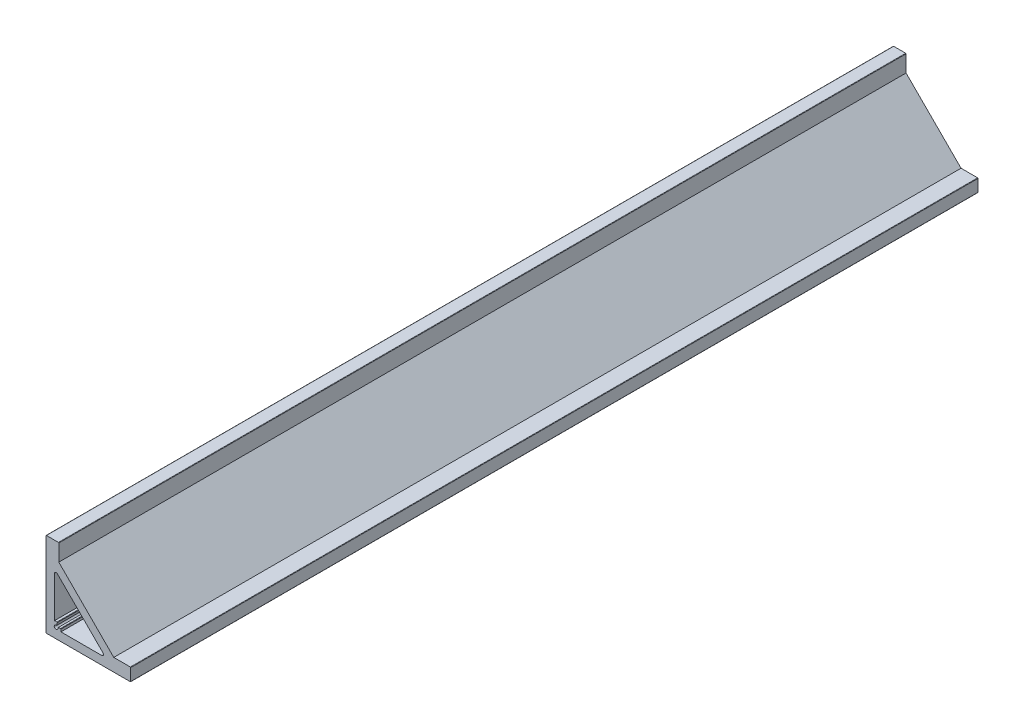
ISO-10303-21;
HEADER;
FILE_DESCRIPTION(('STEP AP214'),'2;1');
FILE_NAME('part.step','',(''),(''),'','','');
FILE_SCHEMA(('AUTOMOTIVE_DESIGN { 1 0 10303 214 1 1 1 1 }'));
ENDSEC;
DATA;
#1=APPLICATION_CONTEXT('core data for automotive mechanical design processes');
#2=APPLICATION_PROTOCOL_DEFINITION('international standard','automotive_design',2000,#1);
#3=PRODUCT_CONTEXT('',#1,'mechanical');
#4=PRODUCT('Part','Part','',(#3));
#5=PRODUCT_RELATED_PRODUCT_CATEGORY('part','',(#4));
#6=PRODUCT_DEFINITION_FORMATION('','',#4);
#7=PRODUCT_DEFINITION_CONTEXT('part definition',#1,'design');
#8=PRODUCT_DEFINITION('design','',#6,#7);
#9=PRODUCT_DEFINITION_SHAPE('','',#8);
#10=(LENGTH_UNIT() NAMED_UNIT(*) SI_UNIT(.MILLI.,.METRE.));
#11=(NAMED_UNIT(*) PLANE_ANGLE_UNIT() SI_UNIT($,.RADIAN.));
#12=(NAMED_UNIT(*) SI_UNIT($,.STERADIAN.) SOLID_ANGLE_UNIT());
#13=UNCERTAINTY_MEASURE_WITH_UNIT(LENGTH_MEASURE(1.E-05),#10,'distance_accuracy_value','');
#14=(GEOMETRIC_REPRESENTATION_CONTEXT(3) GLOBAL_UNCERTAINTY_ASSIGNED_CONTEXT((#13)) GLOBAL_UNIT_ASSIGNED_CONTEXT((#10,
#11,#12)) REPRESENTATION_CONTEXT('',''));
#15=CARTESIAN_POINT('',(0.,0.,0.));
#16=DIRECTION('',(0.,0.,1.));
#17=DIRECTION('',(1.,0.,0.));
#18=AXIS2_PLACEMENT_3D('',#15,#16,#17);
#19=CARTESIAN_POINT('',(0.,0.,1000.));
#20=DIRECTION('',(0.,0.,1.));
#21=DIRECTION('',(1.,0.,0.));
#22=AXIS2_PLACEMENT_3D('',#19,#20,#21);
#23=PLANE('',#22);
#24=DIRECTION('',(-1.,0.,0.));
#25=VECTOR('',#24,1.);
#26=CARTESIAN_POINT('',(15.1,100.,1000.));
#27=LINE('',#26,#25);
#28=CARTESIAN_POINT('',(14.6,100.,1000.));
#29=VERTEX_POINT('',#28);
#30=CARTESIAN_POINT('',(0.5,100.,1000.));
#31=VERTEX_POINT('',#30);
#32=EDGE_CURVE('E251',#29,#31,#27,.T.);
#33=ORIENTED_EDGE('',*,*,#32,.T.);
#34=CARTESIAN_POINT('',(0.5,99.5,1000.));
#35=DIRECTION('',(0.,0.,1.));
#36=DIRECTION('',(1.,0.,0.));
#37=AXIS2_PLACEMENT_3D('',#34,#35,#36);
#38=CIRCLE('',#37,0.5);
#39=CARTESIAN_POINT('',(0.,99.5,1000.));
#40=VERTEX_POINT('',#39);
#41=EDGE_CURVE('E325',#31,#40,#38,.T.);
#42=ORIENTED_EDGE('',*,*,#41,.T.);
#43=DIRECTION('',(0.,-1.,0.));
#44=VECTOR('',#43,1.);
#45=CARTESIAN_POINT('',(0.,100.,1000.));
#46=LINE('',#45,#44);
#47=CARTESIAN_POINT('',(0.,0.5,1000.));
#48=VERTEX_POINT('',#47);
#49=EDGE_CURVE('E254',#40,#48,#46,.T.);
#50=ORIENTED_EDGE('',*,*,#49,.T.);
#51=CARTESIAN_POINT('',(0.5,0.5,1000.));
#52=DIRECTION('',(0.,0.,1.));
#53=DIRECTION('',(1.,0.,0.));
#54=AXIS2_PLACEMENT_3D('',#51,#52,#53);
#55=CIRCLE('',#54,0.5);
#56=CARTESIAN_POINT('',(0.5,0.,1000.));
#57=VERTEX_POINT('',#56);
#58=EDGE_CURVE('E317',#48,#57,#55,.T.);
#59=ORIENTED_EDGE('',*,*,#58,.T.);
#60=DIRECTION('',(1.,0.,0.));
#61=VECTOR('',#60,1.);
#62=CARTESIAN_POINT('',(0.,0.,1000.));
#63=LINE('',#62,#61);
#64=CARTESIAN_POINT('',(99.5,0.,1000.));
#65=VERTEX_POINT('',#64);
#66=EDGE_CURVE('E237',#57,#65,#63,.T.);
#67=ORIENTED_EDGE('',*,*,#66,.T.);
#68=CARTESIAN_POINT('',(99.5,0.5,1000.));
#69=DIRECTION('',(0.,0.,1.));
#70=DIRECTION('',(1.,0.,0.));
#71=AXIS2_PLACEMENT_3D('',#68,#69,#70);
#72=CIRCLE('',#71,0.5);
#73=CARTESIAN_POINT('',(100.,0.5,1000.));
#74=VERTEX_POINT('',#73);
#75=EDGE_CURVE('E319',#65,#74,#72,.T.);
#76=ORIENTED_EDGE('',*,*,#75,.T.);
#77=DIRECTION('',(0.,1.,0.));
#78=VECTOR('',#77,1.);
#79=CARTESIAN_POINT('',(100.,0.,1000.));
#80=LINE('',#79,#78);
#81=CARTESIAN_POINT('',(100.,14.6,1000.));
#82=VERTEX_POINT('',#81);
#83=EDGE_CURVE('E240',#74,#82,#80,.T.);
#84=ORIENTED_EDGE('',*,*,#83,.T.);
#85=CARTESIAN_POINT('',(99.5,14.6,1000.));
#86=DIRECTION('',(0.,0.,1.));
#87=DIRECTION('',(1.,0.,0.));
#88=AXIS2_PLACEMENT_3D('',#85,#86,#87);
#89=CIRCLE('',#88,0.5);
#90=CARTESIAN_POINT('',(99.5,15.1,1000.));
#91=VERTEX_POINT('',#90);
#92=EDGE_CURVE('E321',#82,#91,#89,.T.);
#93=ORIENTED_EDGE('',*,*,#92,.T.);
#94=DIRECTION('',(-1.,0.,0.));
#95=VECTOR('',#94,1.);
#96=CARTESIAN_POINT('',(100.,15.1,1000.));
#97=LINE('',#96,#95);
#98=CARTESIAN_POINT('',(80.,15.1,1000.));
#99=VERTEX_POINT('',#98);
#100=EDGE_CURVE('E244',#91,#99,#97,.T.);
#101=ORIENTED_EDGE('',*,*,#100,.T.);
#102=DIRECTION('',(-0.707106781186548,0.707106781186548,0.));
#103=VECTOR('',#102,1.);
#104=CARTESIAN_POINT('',(80.,15.1,1000.));
#105=LINE('',#104,#103);
#106=CARTESIAN_POINT('',(15.1,80.,1000.));
#107=VERTEX_POINT('',#106);
#108=EDGE_CURVE('E246',#99,#107,#105,.T.);
#109=ORIENTED_EDGE('',*,*,#108,.T.);
#110=DIRECTION('',(0.,1.,0.));
#111=VECTOR('',#110,1.);
#112=CARTESIAN_POINT('',(15.1,80.,1000.));
#113=LINE('',#112,#111);
#114=CARTESIAN_POINT('',(15.1,99.5,1000.));
#115=VERTEX_POINT('',#114);
#116=EDGE_CURVE('E248',#107,#115,#113,.T.);
#117=ORIENTED_EDGE('',*,*,#116,.T.);
#118=CARTESIAN_POINT('',(14.6,99.5,1000.));
#119=DIRECTION('',(0.,0.,1.));
#120=DIRECTION('',(1.,0.,0.));
#121=AXIS2_PLACEMENT_3D('',#118,#119,#120);
#122=CIRCLE('',#121,0.5);
#123=EDGE_CURVE('E323',#115,#29,#122,.T.);
#124=ORIENTED_EDGE('',*,*,#123,.T.);
#125=EDGE_LOOP('',(#33,#42,#50,#59,#67,#76,#84,#93,#101,#109,#117,#124));
#126=FACE_BOUND('',#125,.T.);
#127=CARTESIAN_POINT('',(11.9473045273215,11.8949262472336,1000.));
#128=DIRECTION('',(0.,0.,-1.));
#129=DIRECTION('',(1.,0.,0.));
#130=AXIS2_PLACEMENT_3D('',#127,#128,#129);
#131=CIRCLE('',#130,6.);
#132=CARTESIAN_POINT('',(17.8526329615634,12.9565740625348,1000.));
#133=VERTEX_POINT('',#132);
#134=CARTESIAN_POINT('',(17.6402171840856,9.99999999999999,1000.));
#135=VERTEX_POINT('',#134);
#136=EDGE_CURVE('E198',#133,#135,#131,.T.);
#137=ORIENTED_EDGE('',*,*,#136,.F.);
#138=CARTESIAN_POINT('',(17.3605222587099,12.8681034112597,1000.));
#139=DIRECTION('',(0.,0.,1.));
#140=DIRECTION('',(1.,0.,0.));
#141=AXIS2_PLACEMENT_3D('',#138,#139,#140);
#142=CIRCLE('',#141,0.5);
#143=CARTESIAN_POINT('',(17.2276806104859,13.350133593403,1000.));
#144=VERTEX_POINT('',#143);
#145=EDGE_CURVE('E328',#133,#144,#142,.T.);
#146=ORIENTED_EDGE('',*,*,#145,.T.);
#147=DIRECTION('',(0.964060364286638,0.265683296448074,0.));
#148=VECTOR('',#147,1.);
#149=CARTESIAN_POINT('',(17.7316667130413,13.489026025922,1000.));
#150=LINE('',#149,#148);
#151=CARTESIAN_POINT('',(13.9718312923234,12.4528611697746,1000.));
#152=VERTEX_POINT('',#151);
#153=EDGE_CURVE('E196',#152,#144,#150,.T.);
#154=ORIENTED_EDGE('',*,*,#153,.F.);
#155=CARTESIAN_POINT('',(11.875,11.875,1000.));
#156=DIRECTION('',(0.,0.,1.));
#157=DIRECTION('',(1.,0.,0.));
#158=AXIS2_PLACEMENT_3D('',#155,#156,#157);
#159=CIRCLE('',#158,2.175);
#160=CARTESIAN_POINT('',(12.4528611697746,13.9718312923234,1000.));
#161=VERTEX_POINT('',#160);
#162=EDGE_CURVE('E182',#161,#152,#159,.T.);
#163=ORIENTED_EDGE('',*,*,#162,.F.);
#164=DIRECTION('',(-0.265683296448073,-0.964060364286638,0.));
#165=VECTOR('',#164,1.);
#166=CARTESIAN_POINT('',(12.4528611697746,13.9718312923234,1000.));
#167=LINE('',#166,#165);
#168=CARTESIAN_POINT('',(13.350133593403,17.2276806104859,1000.));
#169=VERTEX_POINT('',#168);
#170=EDGE_CURVE('E176',#169,#161,#167,.T.);
#171=ORIENTED_EDGE('',*,*,#170,.F.);
#172=CARTESIAN_POINT('',(12.8681034112597,17.3605222587099,1000.));
#173=DIRECTION('',(0.,0.,1.));
#174=DIRECTION('',(1.,0.,0.));
#175=AXIS2_PLACEMENT_3D('',#172,#173,#174);
#176=CIRCLE('',#175,0.5);
#177=CARTESIAN_POINT('',(12.9565740625348,17.8526329615634,1000.));
#178=VERTEX_POINT('',#177);
#179=EDGE_CURVE('E31',#169,#178,#176,.T.);
#180=ORIENTED_EDGE('',*,*,#179,.T.);
#181=CARTESIAN_POINT('',(11.8949262472336,11.9473045273215,1000.));
#182=DIRECTION('',(0.,0.,-1.));
#183=DIRECTION('',(1.,0.,0.));
#184=AXIS2_PLACEMENT_3D('',#181,#182,#183);
#185=CIRCLE('',#184,6.);
#186=CARTESIAN_POINT('',(9.99999999999999,17.6402171840856,1000.));
#187=VERTEX_POINT('',#186);
#188=EDGE_CURVE('E183',#187,#178,#185,.T.);
#189=ORIENTED_EDGE('',*,*,#188,.F.);
#190=DIRECTION('',(0.,-1.,0.));
#191=VECTOR('',#190,1.);
#192=CARTESIAN_POINT('',(9.99999999999999,17.6402171840856,1000.));
#193=LINE('',#192,#191);
#194=CARTESIAN_POINT('',(10.,65.8465945390482,1000.));
#195=VERTEX_POINT('',#194);
#196=EDGE_CURVE('E209',#195,#187,#193,.T.);
#197=ORIENTED_EDGE('',*,*,#196,.F.);
#198=CARTESIAN_POINT('',(12.,65.8465945390482,1000.));
#199=DIRECTION('',(0.,0.,1.));
#200=DIRECTION('',(1.,0.,0.));
#201=AXIS2_PLACEMENT_3D('',#198,#199,#200);
#202=CIRCLE('',#201,2.);
#203=CARTESIAN_POINT('',(13.4142135623731,67.2608081014213,1000.));
#204=VERTEX_POINT('',#203);
#205=EDGE_CURVE('E296',#195,#204,#202,.F.);
#206=ORIENTED_EDGE('',*,*,#205,.T.);
#207=DIRECTION('',(-0.707106781186547,0.707106781186548,0.));
#208=VECTOR('',#207,1.);
#209=CARTESIAN_POINT('',(10.,70.6750216637944,1000.));
#210=LINE('',#209,#208);
#211=CARTESIAN_POINT('',(67.2608081014213,13.4142135623731,1000.));
#212=VERTEX_POINT('',#211);
#213=EDGE_CURVE('E206',#212,#204,#210,.T.);
#214=ORIENTED_EDGE('',*,*,#213,.F.);
#215=CARTESIAN_POINT('',(65.8465945390482,12.,1000.));
#216=DIRECTION('',(0.,0.,1.));
#217=DIRECTION('',(1.,0.,0.));
#218=AXIS2_PLACEMENT_3D('',#215,#216,#217);
#219=CIRCLE('',#218,2.);
#220=CARTESIAN_POINT('',(65.8465945390482,10.,1000.));
#221=VERTEX_POINT('',#220);
#222=EDGE_CURVE('E292',#212,#221,#219,.F.);
#223=ORIENTED_EDGE('',*,*,#222,.T.);
#224=DIRECTION('',(1.,0.,0.));
#225=VECTOR('',#224,1.);
#226=CARTESIAN_POINT('',(70.6750216637944,10.,1000.));
#227=LINE('',#226,#225);
#228=EDGE_CURVE('E203',#135,#221,#227,.T.);
#229=ORIENTED_EDGE('',*,*,#228,.F.);
#230=EDGE_LOOP('',(#137,#146,#154,#163,#171,#180,#189,#197,#206,#214,#223,#229));
#231=FACE_BOUND('',#230,.T.);
#232=ADVANCED_FACE('F16',(#126,#231),#23,.T.);
#233=CARTESIAN_POINT('',(0.,0.,0.));
#234=DIRECTION('',(0.,0.,1.));
#235=DIRECTION('',(1.,0.,0.));
#236=AXIS2_PLACEMENT_3D('',#233,#234,#235);
#237=PLANE('',#236);
#238=DIRECTION('',(0.,-1.,0.));
#239=VECTOR('',#238,1.);
#240=CARTESIAN_POINT('',(0.,100.,0.));
#241=LINE('',#240,#239);
#242=CARTESIAN_POINT('',(0.,99.5,0.));
#243=VERTEX_POINT('',#242);
#244=CARTESIAN_POINT('',(0.,0.5,0.));
#245=VERTEX_POINT('',#244);
#246=EDGE_CURVE('E241',#243,#245,#241,.T.);
#247=ORIENTED_EDGE('',*,*,#246,.F.);
#248=CARTESIAN_POINT('',(0.5,99.5,0.));
#249=DIRECTION('',(0.,0.,1.));
#250=DIRECTION('',(1.,0.,0.));
#251=AXIS2_PLACEMENT_3D('',#248,#249,#250);
#252=CIRCLE('',#251,0.5);
#253=CARTESIAN_POINT('',(0.5,100.,0.));
#254=VERTEX_POINT('',#253);
#255=EDGE_CURVE('E309',#243,#254,#252,.F.);
#256=ORIENTED_EDGE('',*,*,#255,.T.);
#257=DIRECTION('',(-1.,0.,0.));
#258=VECTOR('',#257,1.);
#259=CARTESIAN_POINT('',(15.1,100.,0.));
#260=LINE('',#259,#258);
#261=CARTESIAN_POINT('',(14.6,100.,0.));
#262=VERTEX_POINT('',#261);
#263=EDGE_CURVE('E270',#262,#254,#260,.T.);
#264=ORIENTED_EDGE('',*,*,#263,.F.);
#265=CARTESIAN_POINT('',(14.6,99.5,0.));
#266=DIRECTION('',(0.,0.,1.));
#267=DIRECTION('',(1.,0.,0.));
#268=AXIS2_PLACEMENT_3D('',#265,#266,#267);
#269=CIRCLE('',#268,0.5);
#270=CARTESIAN_POINT('',(15.1,99.5,0.));
#271=VERTEX_POINT('',#270);
#272=EDGE_CURVE('E307',#262,#271,#269,.F.);
#273=ORIENTED_EDGE('',*,*,#272,.T.);
#274=DIRECTION('',(0.,1.,0.));
#275=VECTOR('',#274,1.);
#276=CARTESIAN_POINT('',(15.1,80.,0.));
#277=LINE('',#276,#275);
#278=CARTESIAN_POINT('',(15.1,80.,0.));
#279=VERTEX_POINT('',#278);
#280=EDGE_CURVE('E267',#279,#271,#277,.T.);
#281=ORIENTED_EDGE('',*,*,#280,.F.);
#282=DIRECTION('',(-0.707106781186548,0.707106781186548,0.));
#283=VECTOR('',#282,1.);
#284=CARTESIAN_POINT('',(80.,15.1,0.));
#285=LINE('',#284,#283);
#286=CARTESIAN_POINT('',(80.,15.1,0.));
#287=VERTEX_POINT('',#286);
#288=EDGE_CURVE('E265',#287,#279,#285,.T.);
#289=ORIENTED_EDGE('',*,*,#288,.F.);
#290=DIRECTION('',(-1.,0.,0.));
#291=VECTOR('',#290,1.);
#292=CARTESIAN_POINT('',(100.,15.1,0.));
#293=LINE('',#292,#291);
#294=CARTESIAN_POINT('',(99.5,15.1,0.));
#295=VERTEX_POINT('',#294);
#296=EDGE_CURVE('E263',#295,#287,#293,.T.);
#297=ORIENTED_EDGE('',*,*,#296,.F.);
#298=CARTESIAN_POINT('',(99.5,14.6,0.));
#299=DIRECTION('',(0.,0.,1.));
#300=DIRECTION('',(1.,0.,0.));
#301=AXIS2_PLACEMENT_3D('',#298,#299,#300);
#302=CIRCLE('',#301,0.5);
#303=CARTESIAN_POINT('',(100.,14.6,0.));
#304=VERTEX_POINT('',#303);
#305=EDGE_CURVE('E305',#295,#304,#302,.F.);
#306=ORIENTED_EDGE('',*,*,#305,.T.);
#307=DIRECTION('',(0.,1.,0.));
#308=VECTOR('',#307,1.);
#309=CARTESIAN_POINT('',(100.,0.,0.));
#310=LINE('',#309,#308);
#311=CARTESIAN_POINT('',(100.,0.5,0.));
#312=VERTEX_POINT('',#311);
#313=EDGE_CURVE('E260',#312,#304,#310,.T.);
#314=ORIENTED_EDGE('',*,*,#313,.F.);
#315=CARTESIAN_POINT('',(99.5,0.5,0.));
#316=DIRECTION('',(0.,0.,1.));
#317=DIRECTION('',(1.,0.,0.));
#318=AXIS2_PLACEMENT_3D('',#315,#316,#317);
#319=CIRCLE('',#318,0.5);
#320=CARTESIAN_POINT('',(99.5,0.,0.));
#321=VERTEX_POINT('',#320);
#322=EDGE_CURVE('E303',#312,#321,#319,.F.);
#323=ORIENTED_EDGE('',*,*,#322,.T.);
#324=DIRECTION('',(1.,0.,0.));
#325=VECTOR('',#324,1.);
#326=CARTESIAN_POINT('',(0.,0.,0.));
#327=LINE('',#326,#325);
#328=CARTESIAN_POINT('',(0.5,0.,0.));
#329=VERTEX_POINT('',#328);
#330=EDGE_CURVE('E190',#329,#321,#327,.T.);
#331=ORIENTED_EDGE('',*,*,#330,.F.);
#332=CARTESIAN_POINT('',(0.5,0.5,0.));
#333=DIRECTION('',(0.,0.,1.));
#334=DIRECTION('',(1.,0.,0.));
#335=AXIS2_PLACEMENT_3D('',#332,#333,#334);
#336=CIRCLE('',#335,0.5);
#337=EDGE_CURVE('E301',#329,#245,#336,.F.);
#338=ORIENTED_EDGE('',*,*,#337,.T.);
#339=EDGE_LOOP('',(#247,#256,#264,#273,#281,#289,#297,#306,#314,#323,#331,#338));
#340=FACE_BOUND('',#339,.T.);
#341=DIRECTION('',(0.964060364286638,0.265683296448074,0.));
#342=VECTOR('',#341,1.);
#343=CARTESIAN_POINT('',(17.7316667130413,13.489026025922,0.));
#344=LINE('',#343,#342);
#345=CARTESIAN_POINT('',(13.9718312923234,12.4528611697746,0.));
#346=VERTEX_POINT('',#345);
#347=CARTESIAN_POINT('',(17.2276806104859,13.350133593403,0.));
#348=VERTEX_POINT('',#347);
#349=EDGE_CURVE('E218',#346,#348,#344,.T.);
#350=ORIENTED_EDGE('',*,*,#349,.T.);
#351=CARTESIAN_POINT('',(17.3605222587099,12.8681034112597,0.));
#352=DIRECTION('',(0.,0.,1.));
#353=DIRECTION('',(1.,0.,0.));
#354=AXIS2_PLACEMENT_3D('',#351,#352,#353);
#355=CIRCLE('',#354,0.5);
#356=CARTESIAN_POINT('',(17.8526329615634,12.9565740625348,0.));
#357=VERTEX_POINT('',#356);
#358=EDGE_CURVE('E313',#348,#357,#355,.F.);
#359=ORIENTED_EDGE('',*,*,#358,.T.);
#360=CARTESIAN_POINT('',(11.9473045273215,11.8949262472336,0.));
#361=DIRECTION('',(0.,0.,-1.));
#362=DIRECTION('',(1.,0.,0.));
#363=AXIS2_PLACEMENT_3D('',#360,#361,#362);
#364=CIRCLE('',#363,6.);
#365=CARTESIAN_POINT('',(17.6402171840856,9.99999999999999,0.));
#366=VERTEX_POINT('',#365);
#367=EDGE_CURVE('E221',#357,#366,#364,.T.);
#368=ORIENTED_EDGE('',*,*,#367,.T.);
#369=DIRECTION('',(1.,0.,0.));
#370=VECTOR('',#369,1.);
#371=CARTESIAN_POINT('',(70.6750216637944,10.,0.));
#372=LINE('',#371,#370);
#373=CARTESIAN_POINT('',(65.8465945390482,10.,0.));
#374=VERTEX_POINT('',#373);
#375=EDGE_CURVE('E223',#366,#374,#372,.T.);
#376=ORIENTED_EDGE('',*,*,#375,.T.);
#377=CARTESIAN_POINT('',(65.8465945390482,12.,0.));
#378=DIRECTION('',(0.,0.,1.));
#379=DIRECTION('',(1.,0.,0.));
#380=AXIS2_PLACEMENT_3D('',#377,#378,#379);
#381=CIRCLE('',#380,2.);
#382=CARTESIAN_POINT('',(67.2608081014213,13.4142135623731,0.));
#383=VERTEX_POINT('',#382);
#384=EDGE_CURVE('E290',#374,#383,#381,.T.);
#385=ORIENTED_EDGE('',*,*,#384,.T.);
#386=DIRECTION('',(-0.707106781186547,0.707106781186548,0.));
#387=VECTOR('',#386,1.);
#388=CARTESIAN_POINT('',(10.,70.6750216637944,0.));
#389=LINE('',#388,#387);
#390=CARTESIAN_POINT('',(13.4142135623731,67.2608081014213,0.));
#391=VERTEX_POINT('',#390);
#392=EDGE_CURVE('E226',#383,#391,#389,.T.);
#393=ORIENTED_EDGE('',*,*,#392,.T.);
#394=CARTESIAN_POINT('',(12.,65.8465945390482,0.));
#395=DIRECTION('',(0.,0.,1.));
#396=DIRECTION('',(1.,0.,0.));
#397=AXIS2_PLACEMENT_3D('',#394,#395,#396);
#398=CIRCLE('',#397,2.);
#399=CARTESIAN_POINT('',(10.,65.8465945390482,0.));
#400=VERTEX_POINT('',#399);
#401=EDGE_CURVE('E294',#391,#400,#398,.T.);
#402=ORIENTED_EDGE('',*,*,#401,.T.);
#403=DIRECTION('',(0.,-1.,0.));
#404=VECTOR('',#403,1.);
#405=CARTESIAN_POINT('',(9.99999999999999,17.6402171840856,0.));
#406=LINE('',#405,#404);
#407=CARTESIAN_POINT('',(9.99999999999999,17.6402171840856,0.));
#408=VERTEX_POINT('',#407);
#409=EDGE_CURVE('E229',#400,#408,#406,.T.);
#410=ORIENTED_EDGE('',*,*,#409,.T.);
#411=CARTESIAN_POINT('',(11.8949262472336,11.9473045273215,0.));
#412=DIRECTION('',(0.,0.,-1.));
#413=DIRECTION('',(1.,0.,0.));
#414=AXIS2_PLACEMENT_3D('',#411,#412,#413);
#415=CIRCLE('',#414,6.);
#416=CARTESIAN_POINT('',(12.9565740625348,17.8526329615634,0.));
#417=VERTEX_POINT('',#416);
#418=EDGE_CURVE('E212',#408,#417,#415,.T.);
#419=ORIENTED_EDGE('',*,*,#418,.T.);
#420=CARTESIAN_POINT('',(12.8681034112597,17.3605222587099,0.));
#421=DIRECTION('',(0.,0.,1.));
#422=DIRECTION('',(1.,0.,0.));
#423=AXIS2_PLACEMENT_3D('',#420,#421,#422);
#424=CIRCLE('',#423,0.5);
#425=CARTESIAN_POINT('',(13.350133593403,17.2276806104859,0.));
#426=VERTEX_POINT('',#425);
#427=EDGE_CURVE('E311',#417,#426,#424,.F.);
#428=ORIENTED_EDGE('',*,*,#427,.T.);
#429=DIRECTION('',(-0.265683296448073,-0.964060364286638,0.));
#430=VECTOR('',#429,1.);
#431=CARTESIAN_POINT('',(12.4528611697746,13.9718312923234,0.));
#432=LINE('',#431,#430);
#433=CARTESIAN_POINT('',(12.4528611697746,13.9718312923234,0.));
#434=VERTEX_POINT('',#433);
#435=EDGE_CURVE('E215',#426,#434,#432,.T.);
#436=ORIENTED_EDGE('',*,*,#435,.T.);
#437=CARTESIAN_POINT('',(11.875,11.875,0.));
#438=DIRECTION('',(0.,0.,1.));
#439=DIRECTION('',(1.,0.,0.));
#440=AXIS2_PLACEMENT_3D('',#437,#438,#439);
#441=CIRCLE('',#440,2.175);
#442=EDGE_CURVE('E189',#434,#346,#441,.T.);
#443=ORIENTED_EDGE('',*,*,#442,.T.);
#444=EDGE_LOOP('',(#350,#359,#368,#376,#385,#393,#402,#410,#419,#428,#436,#443));
#445=FACE_BOUND('',#444,.T.);
#446=ADVANCED_FACE('F364',(#340,#445),#237,.F.);
#447=CARTESIAN_POINT('',(0.,0.,1000.));
#448=DIRECTION('',(0.,1.,0.));
#449=DIRECTION('',(0.,0.,1.));
#450=AXIS2_PLACEMENT_3D('',#447,#448,#449);
#451=PLANE('',#450);
#452=ORIENTED_EDGE('',*,*,#330,.T.);
#453=DIRECTION('',(0.,0.,-1.));
#454=VECTOR('',#453,1.);
#455=CARTESIAN_POINT('',(99.5,0.,1000.));
#456=LINE('',#455,#454);
#457=EDGE_CURVE('E10',#321,#65,#456,.F.);
#458=ORIENTED_EDGE('',*,*,#457,.T.);
#459=ORIENTED_EDGE('',*,*,#66,.F.);
#460=DIRECTION('',(0.,0.,-1.));
#461=VECTOR('',#460,1.);
#462=CARTESIAN_POINT('',(0.5,0.,1000.));
#463=LINE('',#462,#461);
#464=EDGE_CURVE('E24',#57,#329,#463,.T.);
#465=ORIENTED_EDGE('',*,*,#464,.T.);
#466=EDGE_LOOP('',(#452,#458,#459,#465));
#467=FACE_BOUND('',#466,.T.);
#468=ADVANCED_FACE('F358',(#467),#451,.F.);
#469=CARTESIAN_POINT('',(100.,0.,1000.));
#470=DIRECTION('',(-1.,0.,0.));
#471=DIRECTION('',(0.,0.,1.));
#472=AXIS2_PLACEMENT_3D('',#469,#470,#471);
#473=PLANE('',#472);
#474=ORIENTED_EDGE('',*,*,#313,.T.);
#475=DIRECTION('',(0.,0.,-1.));
#476=VECTOR('',#475,1.);
#477=CARTESIAN_POINT('',(100.,14.6,1000.));
#478=LINE('',#477,#476);
#479=EDGE_CURVE('E352',#304,#82,#478,.F.);
#480=ORIENTED_EDGE('',*,*,#479,.T.);
#481=ORIENTED_EDGE('',*,*,#83,.F.);
#482=DIRECTION('',(0.,0.,-1.));
#483=VECTOR('',#482,1.);
#484=CARTESIAN_POINT('',(100.,0.5,1000.));
#485=LINE('',#484,#483);
#486=EDGE_CURVE('E349',#74,#312,#485,.T.);
#487=ORIENTED_EDGE('',*,*,#486,.T.);
#488=EDGE_LOOP('',(#474,#480,#481,#487));
#489=FACE_BOUND('',#488,.T.);
#490=ADVANCED_FACE('F373',(#489),#473,.F.);
#491=CARTESIAN_POINT('',(100.,15.1,1000.));
#492=DIRECTION('',(0.,-1.,0.));
#493=DIRECTION('',(1.,0.,0.));
#494=AXIS2_PLACEMENT_3D('',#491,#492,#493);
#495=PLANE('',#494);
#496=ORIENTED_EDGE('',*,*,#100,.F.);
#497=DIRECTION('',(0.,0.,-1.));
#498=VECTOR('',#497,1.);
#499=CARTESIAN_POINT('',(99.5,15.1,1000.));
#500=LINE('',#499,#498);
#501=EDGE_CURVE('E346',#91,#295,#500,.T.);
#502=ORIENTED_EDGE('',*,*,#501,.T.);
#503=ORIENTED_EDGE('',*,*,#296,.T.);
#504=DIRECTION('',(0.,0.,-1.));
#505=VECTOR('',#504,1.);
#506=CARTESIAN_POINT('',(80.,15.1,1000.));
#507=LINE('',#506,#505);
#508=EDGE_CURVE('E277',#99,#287,#507,.T.);
#509=ORIENTED_EDGE('',*,*,#508,.F.);
#510=EDGE_LOOP('',(#496,#502,#503,#509));
#511=FACE_BOUND('',#510,.T.);
#512=ADVANCED_FACE('F383',(#511),#495,.F.);
#513=CARTESIAN_POINT('',(80.,15.1,1000.));
#514=DIRECTION('',(-0.707106781186548,-0.707106781186548,0.));
#515=DIRECTION('',(0.707106781186548,-0.707106781186548,0.));
#516=AXIS2_PLACEMENT_3D('',#513,#514,#515);
#517=PLANE('',#516);
#518=ORIENTED_EDGE('',*,*,#288,.T.);
#519=DIRECTION('',(0.,0.,-1.));
#520=VECTOR('',#519,1.);
#521=CARTESIAN_POINT('',(15.1,80.,1000.));
#522=LINE('',#521,#520);
#523=EDGE_CURVE('E257',#107,#279,#522,.T.);
#524=ORIENTED_EDGE('',*,*,#523,.F.);
#525=ORIENTED_EDGE('',*,*,#108,.F.);
#526=ORIENTED_EDGE('',*,*,#508,.T.);
#527=EDGE_LOOP('',(#518,#524,#525,#526));
#528=FACE_BOUND('',#527,.T.);
#529=ADVANCED_FACE('F389',(#528),#517,.F.);
#530=CARTESIAN_POINT('',(15.1,80.,1000.));
#531=DIRECTION('',(-1.,0.,0.));
#532=DIRECTION('',(0.,0.,1.));
#533=AXIS2_PLACEMENT_3D('',#530,#531,#532);
#534=PLANE('',#533);
#535=ORIENTED_EDGE('',*,*,#280,.T.);
#536=DIRECTION('',(0.,0.,-1.));
#537=VECTOR('',#536,1.);
#538=CARTESIAN_POINT('',(15.1,99.5,1000.));
#539=LINE('',#538,#537);
#540=EDGE_CURVE('E344',#271,#115,#539,.F.);
#541=ORIENTED_EDGE('',*,*,#540,.T.);
#542=ORIENTED_EDGE('',*,*,#116,.F.);
#543=ORIENTED_EDGE('',*,*,#523,.T.);
#544=EDGE_LOOP('',(#535,#541,#542,#543));
#545=FACE_BOUND('',#544,.T.);
#546=ADVANCED_FACE('F393',(#545),#534,.F.);
#547=CARTESIAN_POINT('',(15.1,100.,1000.));
#548=DIRECTION('',(0.,-1.,0.));
#549=DIRECTION('',(0.,0.,-1.));
#550=AXIS2_PLACEMENT_3D('',#547,#548,#549);
#551=PLANE('',#550);
#552=ORIENTED_EDGE('',*,*,#263,.T.);
#553=DIRECTION('',(0.,0.,-1.));
#554=VECTOR('',#553,1.);
#555=CARTESIAN_POINT('',(0.5,100.,1000.));
#556=LINE('',#555,#554);
#557=EDGE_CURVE('E342',#254,#31,#556,.F.);
#558=ORIENTED_EDGE('',*,*,#557,.T.);
#559=ORIENTED_EDGE('',*,*,#32,.F.);
#560=DIRECTION('',(0.,0.,-1.));
#561=VECTOR('',#560,1.);
#562=CARTESIAN_POINT('',(14.6,100.,1000.));
#563=LINE('',#562,#561);
#564=EDGE_CURVE('E339',#29,#262,#563,.T.);
#565=ORIENTED_EDGE('',*,*,#564,.T.);
#566=EDGE_LOOP('',(#552,#558,#559,#565));
#567=FACE_BOUND('',#566,.T.);
#568=ADVANCED_FACE('F402',(#567),#551,.F.);
#569=CARTESIAN_POINT('',(0.,100.,1000.));
#570=DIRECTION('',(1.,0.,0.));
#571=DIRECTION('',(0.,1.,0.));
#572=AXIS2_PLACEMENT_3D('',#569,#570,#571);
#573=PLANE('',#572);
#574=ORIENTED_EDGE('',*,*,#49,.F.);
#575=DIRECTION('',(0.,0.,-1.));
#576=VECTOR('',#575,1.);
#577=CARTESIAN_POINT('',(0.,99.5,1000.));
#578=LINE('',#577,#576);
#579=EDGE_CURVE('E336',#40,#243,#578,.T.);
#580=ORIENTED_EDGE('',*,*,#579,.T.);
#581=ORIENTED_EDGE('',*,*,#246,.T.);
#582=DIRECTION('',(0.,0.,-1.));
#583=VECTOR('',#582,1.);
#584=CARTESIAN_POINT('',(0.,0.5,1000.));
#585=LINE('',#584,#583);
#586=EDGE_CURVE('E334',#245,#48,#585,.F.);
#587=ORIENTED_EDGE('',*,*,#586,.T.);
#588=EDGE_LOOP('',(#574,#580,#581,#587));
#589=FACE_BOUND('',#588,.T.);
#590=ADVANCED_FACE('F410',(#589),#573,.F.);
#591=CARTESIAN_POINT('',(11.8949262472336,11.9473045273215,1000.));
#592=DIRECTION('',(0.,0.,-1.));
#593=DIRECTION('',(-1.,0.,0.));
#594=AXIS2_PLACEMENT_3D('',#591,#592,#593);
#595=CYLINDRICAL_SURFACE('',#594,6.);
#596=ORIENTED_EDGE('',*,*,#188,.T.);
#597=DIRECTION('',(0.,0.,-1.));
#598=VECTOR('',#597,1.);
#599=CARTESIAN_POINT('',(12.9565740625348,17.8526329615634,1000.));
#600=LINE('',#599,#598);
#601=EDGE_CURVE('E330',#178,#417,#600,.T.);
#602=ORIENTED_EDGE('',*,*,#601,.T.);
#603=ORIENTED_EDGE('',*,*,#418,.F.);
#604=DIRECTION('',(0.,0.,-1.));
#605=VECTOR('',#604,1.);
#606=CARTESIAN_POINT('',(9.99999999999999,17.6402171840856,1000.));
#607=LINE('',#606,#605);
#608=EDGE_CURVE('E211',#187,#408,#607,.T.);
#609=ORIENTED_EDGE('',*,*,#608,.F.);
#610=EDGE_LOOP('',(#596,#602,#603,#609));
#611=FACE_BOUND('',#610,.T.);
#612=ADVANCED_FACE('F424',(#611),#595,.T.);
#613=CARTESIAN_POINT('',(12.4528611697746,13.9718312923234,1000.));
#614=DIRECTION('',(0.964060364286638,-0.265683296448073,0.));
#615=DIRECTION('',(0.265683296448073,0.964060364286638,0.));
#616=AXIS2_PLACEMENT_3D('',#613,#614,#615);
#617=PLANE('',#616);
#618=ORIENTED_EDGE('',*,*,#435,.F.);
#619=DIRECTION('',(0.,0.,-1.));
#620=VECTOR('',#619,1.);
#621=CARTESIAN_POINT('',(13.350133593403,17.2276806104859,1000.));
#622=LINE('',#621,#620);
#623=EDGE_CURVE('E39',#426,#169,#622,.F.);
#624=ORIENTED_EDGE('',*,*,#623,.T.);
#625=ORIENTED_EDGE('',*,*,#170,.T.);
#626=DIRECTION('',(0.,0.,-1.));
#627=VECTOR('',#626,1.);
#628=CARTESIAN_POINT('',(12.4528611697746,13.9718312923234,1000.));
#629=LINE('',#628,#627);
#630=EDGE_CURVE('E179',#161,#434,#629,.T.);
#631=ORIENTED_EDGE('',*,*,#630,.T.);
#632=EDGE_LOOP('',(#618,#624,#625,#631));
#633=FACE_BOUND('',#632,.T.);
#634=ADVANCED_FACE('F178',(#633),#617,.T.);
#635=CARTESIAN_POINT('',(11.875,11.875,1000.));
#636=DIRECTION('',(0.,0.,-1.));
#637=DIRECTION('',(-1.,0.,0.));
#638=AXIS2_PLACEMENT_3D('',#635,#636,#637);
#639=CYLINDRICAL_SURFACE('',#638,2.175);
#640=ORIENTED_EDGE('',*,*,#442,.F.);
#641=ORIENTED_EDGE('',*,*,#630,.F.);
#642=ORIENTED_EDGE('',*,*,#162,.T.);
#643=DIRECTION('',(0.,0.,-1.));
#644=VECTOR('',#643,1.);
#645=CARTESIAN_POINT('',(13.9718312923234,12.4528611697746,1000.));
#646=LINE('',#645,#644);
#647=EDGE_CURVE('E191',#152,#346,#646,.T.);
#648=ORIENTED_EDGE('',*,*,#647,.T.);
#649=EDGE_LOOP('',(#640,#641,#642,#648));
#650=FACE_BOUND('',#649,.T.);
#651=ADVANCED_FACE('F186',(#650),#639,.F.);
#652=CARTESIAN_POINT('',(17.7316667130413,13.489026025922,1000.));
#653=DIRECTION('',(-0.265683296448074,0.964060364286638,0.));
#654=DIRECTION('',(-0.964060364286638,-0.265683296448074,0.));
#655=AXIS2_PLACEMENT_3D('',#652,#653,#654);
#656=PLANE('',#655);
#657=ORIENTED_EDGE('',*,*,#153,.T.);
#658=DIRECTION('',(0.,0.,-1.));
#659=VECTOR('',#658,1.);
#660=CARTESIAN_POINT('',(17.2276806104859,13.350133593403,1000.));
#661=LINE('',#660,#659);
#662=EDGE_CURVE('E298',#144,#348,#661,.T.);
#663=ORIENTED_EDGE('',*,*,#662,.T.);
#664=ORIENTED_EDGE('',*,*,#349,.F.);
#665=ORIENTED_EDGE('',*,*,#647,.F.);
#666=EDGE_LOOP('',(#657,#663,#664,#665));
#667=FACE_BOUND('',#666,.T.);
#668=ADVANCED_FACE('F594',(#667),#656,.T.);
#669=CARTESIAN_POINT('',(11.9473045273215,11.8949262472336,1000.));
#670=DIRECTION('',(0.,0.,-1.));
#671=DIRECTION('',(-1.,0.,0.));
#672=AXIS2_PLACEMENT_3D('',#669,#670,#671);
#673=CYLINDRICAL_SURFACE('',#672,6.);
#674=ORIENTED_EDGE('',*,*,#367,.F.);
#675=DIRECTION('',(0.,0.,-1.));
#676=VECTOR('',#675,1.);
#677=CARTESIAN_POINT('',(17.8526329615634,12.9565740625348,1000.));
#678=LINE('',#677,#676);
#679=EDGE_CURVE('E315',#357,#133,#678,.F.);
#680=ORIENTED_EDGE('',*,*,#679,.T.);
#681=ORIENTED_EDGE('',*,*,#136,.T.);
#682=DIRECTION('',(0.,0.,-1.));
#683=VECTOR('',#682,1.);
#684=CARTESIAN_POINT('',(17.6402171840856,9.99999999999999,1000.));
#685=LINE('',#684,#683);
#686=EDGE_CURVE('E233',#135,#366,#685,.T.);
#687=ORIENTED_EDGE('',*,*,#686,.T.);
#688=EDGE_LOOP('',(#674,#680,#681,#687));
#689=FACE_BOUND('',#688,.T.);
#690=ADVANCED_FACE('F585',(#689),#673,.T.);
#691=CARTESIAN_POINT('',(70.6750216637944,10.,1000.));
#692=DIRECTION('',(0.,1.,0.));
#693=DIRECTION('',(-1.,0.,0.));
#694=AXIS2_PLACEMENT_3D('',#691,#692,#693);
#695=PLANE('',#694);
#696=ORIENTED_EDGE('',*,*,#228,.T.);
#697=DIRECTION('',(0.,0.,-1.));
#698=VECTOR('',#697,1.);
#699=CARTESIAN_POINT('',(65.8465945390482,10.,0.));
#700=LINE('',#699,#698);
#701=EDGE_CURVE('E280',#221,#374,#700,.T.);
#702=ORIENTED_EDGE('',*,*,#701,.T.);
#703=ORIENTED_EDGE('',*,*,#375,.F.);
#704=ORIENTED_EDGE('',*,*,#686,.F.);
#705=EDGE_LOOP('',(#696,#702,#703,#704));
#706=FACE_BOUND('',#705,.T.);
#707=ADVANCED_FACE('F576',(#706),#695,.T.);
#708=CARTESIAN_POINT('',(10.,70.6750216637944,1000.));
#709=DIRECTION('',(-0.707106781186548,-0.707106781186547,0.));
#710=DIRECTION('',(0.707106781186547,-0.707106781186548,0.));
#711=AXIS2_PLACEMENT_3D('',#708,#709,#710);
#712=PLANE('',#711);
#713=ORIENTED_EDGE('',*,*,#392,.F.);
#714=DIRECTION('',(0.,0.,-1.));
#715=VECTOR('',#714,1.);
#716=CARTESIAN_POINT('',(67.2608081014213,13.4142135623731,1000.));
#717=LINE('',#716,#715);
#718=EDGE_CURVE('E286',#383,#212,#717,.F.);
#719=ORIENTED_EDGE('',*,*,#718,.T.);
#720=ORIENTED_EDGE('',*,*,#213,.T.);
#721=DIRECTION('',(0.,0.,-1.));
#722=VECTOR('',#721,1.);
#723=CARTESIAN_POINT('',(13.4142135623731,67.2608081014213,0.));
#724=LINE('',#723,#722);
#725=EDGE_CURVE('E283',#204,#391,#724,.T.);
#726=ORIENTED_EDGE('',*,*,#725,.T.);
#727=EDGE_LOOP('',(#713,#719,#720,#726));
#728=FACE_BOUND('',#727,.T.);
#729=ADVANCED_FACE('F567',(#728),#712,.T.);
#730=CARTESIAN_POINT('',(9.99999999999999,17.6402171840856,1000.));
#731=DIRECTION('',(1.,0.,0.));
#732=DIRECTION('',(0.,1.,0.));
#733=AXIS2_PLACEMENT_3D('',#730,#731,#732);
#734=PLANE('',#733);
#735=ORIENTED_EDGE('',*,*,#409,.F.);
#736=DIRECTION('',(0.,0.,-1.));
#737=VECTOR('',#736,1.);
#738=CARTESIAN_POINT('',(10.,65.8465945390482,1000.));
#739=LINE('',#738,#737);
#740=EDGE_CURVE('E288',#400,#195,#739,.F.);
#741=ORIENTED_EDGE('',*,*,#740,.T.);
#742=ORIENTED_EDGE('',*,*,#196,.T.);
#743=ORIENTED_EDGE('',*,*,#608,.T.);
#744=EDGE_LOOP('',(#735,#741,#742,#743));
#745=FACE_BOUND('',#744,.T.);
#746=ADVANCED_FACE('F445',(#745),#734,.T.);
#747=CARTESIAN_POINT('',(65.8465945390482,12.,1000.));
#748=DIRECTION('',(0.,0.,1.));
#749=DIRECTION('',(1.,0.,0.));
#750=AXIS2_PLACEMENT_3D('',#747,#748,#749);
#751=CYLINDRICAL_SURFACE('',#750,2.);
#752=ORIENTED_EDGE('',*,*,#222,.F.);
#753=ORIENTED_EDGE('',*,*,#718,.F.);
#754=ORIENTED_EDGE('',*,*,#384,.F.);
#755=ORIENTED_EDGE('',*,*,#701,.F.);
#756=EDGE_LOOP('',(#752,#753,#754,#755));
#757=FACE_BOUND('',#756,.T.);
#758=ADVANCED_FACE('F441',(#757),#751,.F.);
#759=CARTESIAN_POINT('',(12.,65.8465945390482,1000.));
#760=DIRECTION('',(0.,0.,1.));
#761=DIRECTION('',(1.,0.,0.));
#762=AXIS2_PLACEMENT_3D('',#759,#760,#761);
#763=CYLINDRICAL_SURFACE('',#762,2.);
#764=ORIENTED_EDGE('',*,*,#205,.F.);
#765=ORIENTED_EDGE('',*,*,#740,.F.);
#766=ORIENTED_EDGE('',*,*,#401,.F.);
#767=ORIENTED_EDGE('',*,*,#725,.F.);
#768=EDGE_LOOP('',(#764,#765,#766,#767));
#769=FACE_BOUND('',#768,.T.);
#770=ADVANCED_FACE('F444',(#769),#763,.F.);
#771=CARTESIAN_POINT('',(17.3605222587099,12.8681034112597,1000.));
#772=DIRECTION('',(0.,0.,-1.));
#773=DIRECTION('',(-1.,0.,0.));
#774=AXIS2_PLACEMENT_3D('',#771,#772,#773);
#775=CYLINDRICAL_SURFACE('',#774,0.5);
#776=ORIENTED_EDGE('',*,*,#145,.F.);
#777=ORIENTED_EDGE('',*,*,#679,.F.);
#778=ORIENTED_EDGE('',*,*,#358,.F.);
#779=ORIENTED_EDGE('',*,*,#662,.F.);
#780=EDGE_LOOP('',(#776,#777,#778,#779));
#781=FACE_BOUND('',#780,.T.);
#782=ADVANCED_FACE('F449',(#781),#775,.T.);
#783=CARTESIAN_POINT('',(12.8681034112597,17.3605222587099,1000.));
#784=DIRECTION('',(0.,0.,-1.));
#785=DIRECTION('',(-1.,0.,0.));
#786=AXIS2_PLACEMENT_3D('',#783,#784,#785);
#787=CYLINDRICAL_SURFACE('',#786,0.5);
#788=ORIENTED_EDGE('',*,*,#179,.F.);
#789=ORIENTED_EDGE('',*,*,#623,.F.);
#790=ORIENTED_EDGE('',*,*,#427,.F.);
#791=ORIENTED_EDGE('',*,*,#601,.F.);
#792=EDGE_LOOP('',(#788,#789,#790,#791));
#793=FACE_BOUND('',#792,.T.);
#794=ADVANCED_FACE('F453',(#793),#787,.T.);
#795=CARTESIAN_POINT('',(0.5,99.5,1000.));
#796=DIRECTION('',(0.,0.,-1.));
#797=DIRECTION('',(-1.,0.,0.));
#798=AXIS2_PLACEMENT_3D('',#795,#796,#797);
#799=CYLINDRICAL_SURFACE('',#798,0.5);
#800=ORIENTED_EDGE('',*,*,#41,.F.);
#801=ORIENTED_EDGE('',*,*,#557,.F.);
#802=ORIENTED_EDGE('',*,*,#255,.F.);
#803=ORIENTED_EDGE('',*,*,#579,.F.);
#804=EDGE_LOOP('',(#800,#801,#802,#803));
#805=FACE_BOUND('',#804,.T.);
#806=ADVANCED_FACE('F407',(#805),#799,.T.);
#807=CARTESIAN_POINT('',(14.6,99.5,1000.));
#808=DIRECTION('',(0.,0.,-1.));
#809=DIRECTION('',(-1.,0.,0.));
#810=AXIS2_PLACEMENT_3D('',#807,#808,#809);
#811=CYLINDRICAL_SURFACE('',#810,0.5);
#812=ORIENTED_EDGE('',*,*,#123,.F.);
#813=ORIENTED_EDGE('',*,*,#540,.F.);
#814=ORIENTED_EDGE('',*,*,#272,.F.);
#815=ORIENTED_EDGE('',*,*,#564,.F.);
#816=EDGE_LOOP('',(#812,#813,#814,#815));
#817=FACE_BOUND('',#816,.T.);
#818=ADVANCED_FACE('F399',(#817),#811,.T.);
#819=CARTESIAN_POINT('',(99.5,14.6,1000.));
#820=DIRECTION('',(0.,0.,-1.));
#821=DIRECTION('',(-1.,0.,0.));
#822=AXIS2_PLACEMENT_3D('',#819,#820,#821);
#823=CYLINDRICAL_SURFACE('',#822,0.5);
#824=ORIENTED_EDGE('',*,*,#92,.F.);
#825=ORIENTED_EDGE('',*,*,#479,.F.);
#826=ORIENTED_EDGE('',*,*,#305,.F.);
#827=ORIENTED_EDGE('',*,*,#501,.F.);
#828=EDGE_LOOP('',(#824,#825,#826,#827));
#829=FACE_BOUND('',#828,.T.);
#830=ADVANCED_FACE('F380',(#829),#823,.T.);
#831=CARTESIAN_POINT('',(99.5,0.5,1000.));
#832=DIRECTION('',(0.,0.,-1.));
#833=DIRECTION('',(-1.,0.,0.));
#834=AXIS2_PLACEMENT_3D('',#831,#832,#833);
#835=CYLINDRICAL_SURFACE('',#834,0.5);
#836=ORIENTED_EDGE('',*,*,#75,.F.);
#837=ORIENTED_EDGE('',*,*,#457,.F.);
#838=ORIENTED_EDGE('',*,*,#322,.F.);
#839=ORIENTED_EDGE('',*,*,#486,.F.);
#840=EDGE_LOOP('',(#836,#837,#838,#839));
#841=FACE_BOUND('',#840,.T.);
#842=ADVANCED_FACE('F370',(#841),#835,.T.);
#843=CARTESIAN_POINT('',(0.5,0.5,1000.));
#844=DIRECTION('',(0.,0.,-1.));
#845=DIRECTION('',(-1.,0.,0.));
#846=AXIS2_PLACEMENT_3D('',#843,#844,#845);
#847=CYLINDRICAL_SURFACE('',#846,0.5);
#848=ORIENTED_EDGE('',*,*,#58,.F.);
#849=ORIENTED_EDGE('',*,*,#586,.F.);
#850=ORIENTED_EDGE('',*,*,#337,.F.);
#851=ORIENTED_EDGE('',*,*,#464,.F.);
#852=EDGE_LOOP('',(#848,#849,#850,#851));
#853=FACE_BOUND('',#852,.T.);
#854=ADVANCED_FACE('F18',(#853),#847,.T.);
#855=CLOSED_SHELL('',(#232,#446,#468,#490,#512,#529,#546,#568,#590,#612,#634,#651,#668,#690,
#707,#729,#746,#758,#770,#782,#794,#806,#818,#830,#842,#854));
#856=MANIFOLD_SOLID_BREP('B1',#855);
#857=ADVANCED_BREP_SHAPE_REPRESENTATION('',(#18,#856),#14);
#858=SHAPE_DEFINITION_REPRESENTATION(#9,#857);
ENDSEC;
END-ISO-10303-21;
